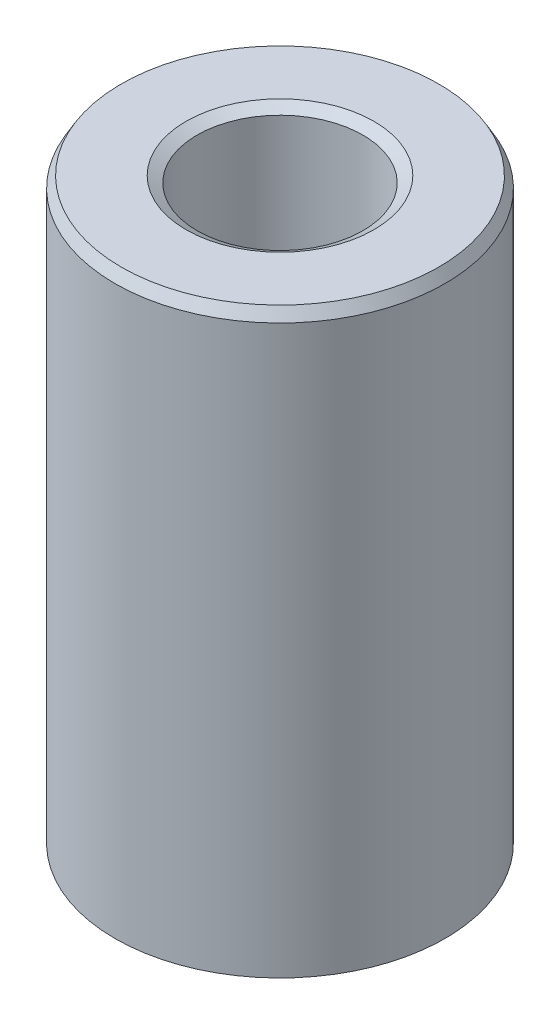
ISO-10303-21;
HEADER;
FILE_DESCRIPTION(('STEP AP214'),'2;1');
FILE_NAME('part.step','',(''),(''),'','','');
FILE_SCHEMA(('AUTOMOTIVE_DESIGN { 1 0 10303 214 1 1 1 1 }'));
ENDSEC;
DATA;
#1=APPLICATION_CONTEXT('core data for automotive mechanical design processes');
#2=APPLICATION_PROTOCOL_DEFINITION('international standard','automotive_design',2000,#1);
#3=PRODUCT_CONTEXT('',#1,'mechanical');
#4=PRODUCT('Part','Part','',(#3));
#5=PRODUCT_RELATED_PRODUCT_CATEGORY('part','',(#4));
#6=PRODUCT_DEFINITION_FORMATION('','',#4);
#7=PRODUCT_DEFINITION_CONTEXT('part definition',#1,'design');
#8=PRODUCT_DEFINITION('design','',#6,#7);
#9=PRODUCT_DEFINITION_SHAPE('','',#8);
#10=(LENGTH_UNIT() NAMED_UNIT(*) SI_UNIT(.MILLI.,.METRE.));
#11=(NAMED_UNIT(*) PLANE_ANGLE_UNIT() SI_UNIT($,.RADIAN.));
#12=(NAMED_UNIT(*) SI_UNIT($,.STERADIAN.) SOLID_ANGLE_UNIT());
#13=UNCERTAINTY_MEASURE_WITH_UNIT(LENGTH_MEASURE(1.E-05),#10,'distance_accuracy_value','');
#14=(GEOMETRIC_REPRESENTATION_CONTEXT(3) GLOBAL_UNCERTAINTY_ASSIGNED_CONTEXT((#13)) GLOBAL_UNIT_ASSIGNED_CONTEXT((#10,
#11,#12)) REPRESENTATION_CONTEXT('',''));
#15=CARTESIAN_POINT('',(0.,0.,0.));
#16=DIRECTION('',(0.,0.,1.));
#17=DIRECTION('',(1.,0.,0.));
#18=AXIS2_PLACEMENT_3D('',#15,#16,#17);
#19=CARTESIAN_POINT('',(0.,26.5610149132607,0.));
#20=DIRECTION('',(0.,-1.,0.));
#21=DIRECTION('',(0.,0.,-1.));
#22=AXIS2_PLACEMENT_3D('',#19,#20,#21);
#23=CYLINDRICAL_SURFACE('',#22,7.5);
#24=CARTESIAN_POINT('',(0.,0.289449105211982,0.));
#25=DIRECTION('',(0.,1.,0.));
#26=DIRECTION('',(0.,0.,1.));
#27=AXIS2_PLACEMENT_3D('',#24,#25,#26);
#28=CIRCLE('',#27,7.5);
#29=CARTESIAN_POINT('',(0.,0.289449105211982,7.5));
#30=VERTEX_POINT('',#29);
#31=EDGE_CURVE('E10',#30,#30,#28,.T.);
#32=ORIENTED_EDGE('',*,*,#31,.T.);
#33=EDGE_LOOP('',(#32));
#34=FACE_BOUND('',#33,.T.);
#35=CARTESIAN_POINT('',(0.,26.0596743568282,0.));
#36=DIRECTION('',(0.,1.,0.));
#37=DIRECTION('',(0.,0.,1.));
#38=AXIS2_PLACEMENT_3D('',#35,#36,#37);
#39=CIRCLE('',#38,7.5);
#40=CARTESIAN_POINT('',(0.,26.0596743568282,7.5));
#41=VERTEX_POINT('',#40);
#42=EDGE_CURVE('E50',#41,#41,#39,.F.);
#43=ORIENTED_EDGE('',*,*,#42,.T.);
#44=EDGE_LOOP('',(#43));
#45=FACE_BOUND('',#44,.T.);
#46=ADVANCED_FACE('F39',(#34,#45),#23,.T.);
#47=CARTESIAN_POINT('',(0.,26.5610149132607,0.));
#48=DIRECTION('',(0.,1.,0.));
#49=DIRECTION('',(0.,0.,1.));
#50=AXIS2_PLACEMENT_3D('',#47,#48,#49);
#51=PLANE('',#50);
#52=CARTESIAN_POINT('',(0.,26.5610149132607,0.));
#53=DIRECTION('',(0.,1.,0.));
#54=DIRECTION('',(0.,0.,1.));
#55=AXIS2_PLACEMENT_3D('',#52,#53,#54);
#56=CIRCLE('',#55,4.26815271569414);
#57=CARTESIAN_POINT('',(0.,26.5610149132607,4.26815271569414));
#58=VERTEX_POINT('',#57);
#59=EDGE_CURVE('E58',#58,#58,#56,.F.);
#60=ORIENTED_EDGE('',*,*,#59,.T.);
#61=EDGE_LOOP('',(#60));
#62=FACE_BOUND('',#61,.T.);
#63=CARTESIAN_POINT('',(0.,26.5610149132607,0.));
#64=DIRECTION('',(0.,1.,0.));
#65=DIRECTION('',(0.,0.,1.));
#66=AXIS2_PLACEMENT_3D('',#63,#64,#65);
#67=CIRCLE('',#66,7.21055089478802);
#68=CARTESIAN_POINT('',(0.,26.5610149132607,7.21055089478802));
#69=VERTEX_POINT('',#68);
#70=EDGE_CURVE('E61',#69,#69,#67,.T.);
#71=ORIENTED_EDGE('',*,*,#70,.T.);
#72=EDGE_LOOP('',(#71));
#73=FACE_BOUND('',#72,.T.);
#74=ADVANCED_FACE('F88',(#62,#73),#51,.T.);
#75=CARTESIAN_POINT('',(0.,0.,0.));
#76=DIRECTION('',(0.,1.,0.));
#77=DIRECTION('',(0.,0.,1.));
#78=AXIS2_PLACEMENT_3D('',#75,#76,#77);
#79=PLANE('',#78);
#80=CARTESIAN_POINT('',(0.,0.,0.));
#81=DIRECTION('',(0.,1.,0.));
#82=DIRECTION('',(0.,0.,1.));
#83=AXIS2_PLACEMENT_3D('',#80,#81,#82);
#84=CIRCLE('',#83,4.05626126447363);
#85=CARTESIAN_POINT('',(0.,0.,4.05626126447363));
#86=VERTEX_POINT('',#85);
#87=EDGE_CURVE('E51',#86,#86,#84,.T.);
#88=ORIENTED_EDGE('',*,*,#87,.T.);
#89=EDGE_LOOP('',(#88));
#90=FACE_BOUND('',#89,.T.);
#91=CARTESIAN_POINT('',(0.,0.,0.));
#92=DIRECTION('',(0.,1.,0.));
#93=DIRECTION('',(0.,0.,1.));
#94=AXIS2_PLACEMENT_3D('',#91,#92,#93);
#95=CIRCLE('',#94,6.9986594435675);
#96=CARTESIAN_POINT('',(0.,0.,6.9986594435675));
#97=VERTEX_POINT('',#96);
#98=EDGE_CURVE('E54',#97,#97,#95,.F.);
#99=ORIENTED_EDGE('',*,*,#98,.T.);
#100=EDGE_LOOP('',(#99));
#101=FACE_BOUND('',#100,.T.);
#102=ADVANCED_FACE('F83',(#90,#101),#79,.F.);
#103=CARTESIAN_POINT('',(0.,26.5610149132607,0.));
#104=DIRECTION('',(0.,-1.,0.));
#105=DIRECTION('',(0.,0.,-1.));
#106=AXIS2_PLACEMENT_3D('',#103,#104,#105);
#107=CYLINDRICAL_SURFACE('',#106,3.76681215926165);
#108=CARTESIAN_POINT('',(0.,26.2715658080487,0.));
#109=DIRECTION('',(0.,1.,0.));
#110=DIRECTION('',(0.,0.,1.));
#111=AXIS2_PLACEMENT_3D('',#108,#109,#110);
#112=CIRCLE('',#111,3.76681215926165);
#113=CARTESIAN_POINT('',(0.,26.2715658080487,3.76681215926165));
#114=VERTEX_POINT('',#113);
#115=EDGE_CURVE('E67',#114,#114,#112,.T.);
#116=ORIENTED_EDGE('',*,*,#115,.T.);
#117=EDGE_LOOP('',(#116));
#118=FACE_BOUND('',#117,.T.);
#119=CARTESIAN_POINT('',(0.,0.501340556432511,0.));
#120=DIRECTION('',(0.,1.,0.));
#121=DIRECTION('',(0.,0.,1.));
#122=AXIS2_PLACEMENT_3D('',#119,#120,#121);
#123=CIRCLE('',#122,3.76681215926165);
#124=CARTESIAN_POINT('',(0.,0.501340556432511,3.76681215926165));
#125=VERTEX_POINT('',#124);
#126=EDGE_CURVE('E69',#125,#125,#123,.F.);
#127=ORIENTED_EDGE('',*,*,#126,.T.);
#128=EDGE_LOOP('',(#127));
#129=FACE_BOUND('',#128,.T.);
#130=ADVANCED_FACE('F71',(#118,#129),#107,.F.);
#131=CARTESIAN_POINT('',(0.,26.2715658080487,0.));
#132=DIRECTION('',(0.,1.,0.));
#133=DIRECTION('',(0.,0.,1.));
#134=AXIS2_PLACEMENT_3D('',#131,#132,#133);
#135=CONICAL_SURFACE('',#134,3.76681215926165,1.04719755119661);
#136=ORIENTED_EDGE('',*,*,#59,.F.);
#137=EDGE_LOOP('',(#136));
#138=FACE_BOUND('',#137,.T.);
#139=ORIENTED_EDGE('',*,*,#115,.F.);
#140=EDGE_LOOP('',(#139));
#141=FACE_BOUND('',#140,.T.);
#142=ADVANCED_FACE('F77',(#138,#141),#135,.F.);
#143=CARTESIAN_POINT('',(0.,0.,0.));
#144=DIRECTION('',(0.,-1.,0.));
#145=DIRECTION('',(0.,0.,-1.));
#146=AXIS2_PLACEMENT_3D('',#143,#144,#145);
#147=CONICAL_SURFACE('',#146,4.05626126447363,0.523598775598295);
#148=ORIENTED_EDGE('',*,*,#126,.F.);
#149=EDGE_LOOP('',(#148));
#150=FACE_BOUND('',#149,.T.);
#151=ORIENTED_EDGE('',*,*,#87,.F.);
#152=EDGE_LOOP('',(#151));
#153=FACE_BOUND('',#152,.T.);
#154=ADVANCED_FACE('F73',(#150,#153),#147,.F.);
#155=CARTESIAN_POINT('',(0.,0.289449105211982,0.));
#156=DIRECTION('',(0.,1.,0.));
#157=DIRECTION('',(0.,0.,1.));
#158=AXIS2_PLACEMENT_3D('',#155,#156,#157);
#159=CONICAL_SURFACE('',#158,7.5,1.0471975511966);
#160=ORIENTED_EDGE('',*,*,#98,.F.);
#161=EDGE_LOOP('',(#160));
#162=FACE_BOUND('',#161,.T.);
#163=ORIENTED_EDGE('',*,*,#31,.F.);
#164=EDGE_LOOP('',(#163));
#165=FACE_BOUND('',#164,.T.);
#166=ADVANCED_FACE('F76',(#162,#165),#159,.T.);
#167=CARTESIAN_POINT('',(0.,26.5610149132607,0.));
#168=DIRECTION('',(0.,-1.,0.));
#169=DIRECTION('',(0.,0.,-1.));
#170=AXIS2_PLACEMENT_3D('',#167,#168,#169);
#171=CONICAL_SURFACE('',#170,7.21055089478802,0.523598775598298);
#172=ORIENTED_EDGE('',*,*,#42,.F.);
#173=EDGE_LOOP('',(#172));
#174=FACE_BOUND('',#173,.T.);
#175=ORIENTED_EDGE('',*,*,#70,.F.);
#176=EDGE_LOOP('',(#175));
#177=FACE_BOUND('',#176,.T.);
#178=ADVANCED_FACE('F45',(#174,#177),#171,.T.);
#179=CLOSED_SHELL('',(#46,#74,#102,#130,#142,#154,#166,#178));
#180=MANIFOLD_SOLID_BREP('B2',#179);
#181=ADVANCED_BREP_SHAPE_REPRESENTATION('',(#18,#180),#14);
#182=SHAPE_DEFINITION_REPRESENTATION(#9,#181);
ENDSEC;
END-ISO-10303-21;
